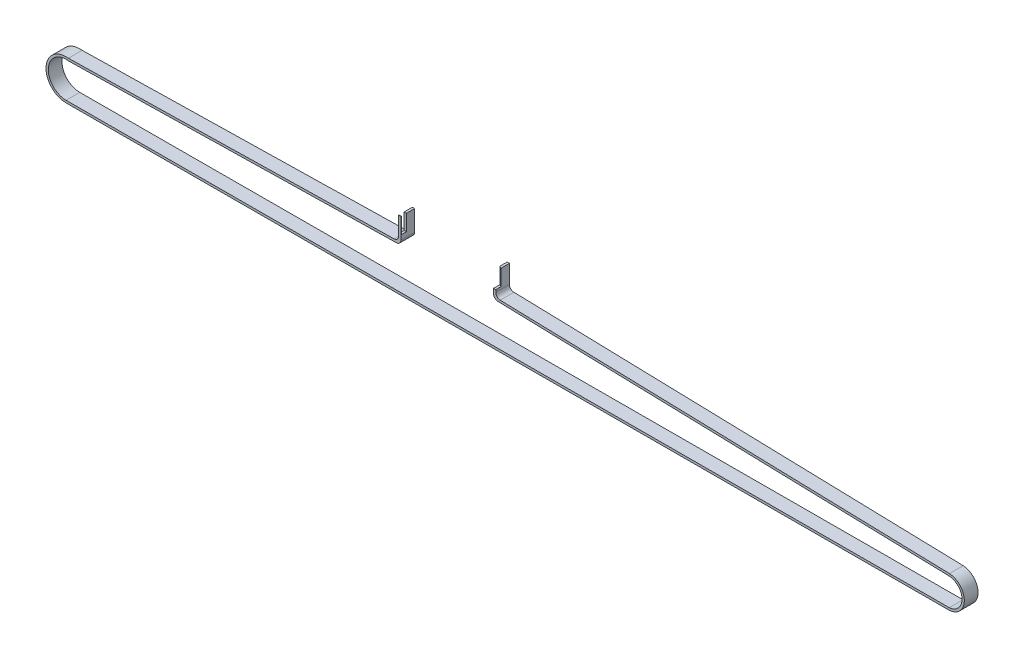
ISO-10303-21;
HEADER;
FILE_DESCRIPTION(('STEP AP214'),'2;1');
FILE_NAME('part.step','',(''),(''),'','','');
FILE_SCHEMA(('AUTOMOTIVE_DESIGN { 1 0 10303 214 1 1 1 1 }'));
ENDSEC;
DATA;
#1=APPLICATION_CONTEXT('core data for automotive mechanical design processes');
#2=APPLICATION_PROTOCOL_DEFINITION('international standard','automotive_design',2000,#1);
#3=PRODUCT_CONTEXT('',#1,'mechanical');
#4=PRODUCT('Part','Part','',(#3));
#5=PRODUCT_RELATED_PRODUCT_CATEGORY('part','',(#4));
#6=PRODUCT_DEFINITION_FORMATION('','',#4);
#7=PRODUCT_DEFINITION_CONTEXT('part definition',#1,'design');
#8=PRODUCT_DEFINITION('design','',#6,#7);
#9=PRODUCT_DEFINITION_SHAPE('','',#8);
#10=(LENGTH_UNIT() NAMED_UNIT(*) SI_UNIT(.MILLI.,.METRE.));
#11=(NAMED_UNIT(*) PLANE_ANGLE_UNIT() SI_UNIT($,.RADIAN.));
#12=(NAMED_UNIT(*) SI_UNIT($,.STERADIAN.) SOLID_ANGLE_UNIT());
#13=UNCERTAINTY_MEASURE_WITH_UNIT(LENGTH_MEASURE(1.E-05),#10,'distance_accuracy_value','');
#14=(GEOMETRIC_REPRESENTATION_CONTEXT(3) GLOBAL_UNCERTAINTY_ASSIGNED_CONTEXT((#13)) GLOBAL_UNIT_ASSIGNED_CONTEXT((#10,
#11,#12)) REPRESENTATION_CONTEXT('',''));
#15=CARTESIAN_POINT('',(0.,0.,0.));
#16=DIRECTION('',(0.,0.,1.));
#17=DIRECTION('',(1.,0.,0.));
#18=AXIS2_PLACEMENT_3D('',#15,#16,#17);
#19=CARTESIAN_POINT('',(-77.6123917073383,-109.1707684477,6.56356693467296));
#20=DIRECTION('',(0.,1.,0.));
#21=DIRECTION('',(0.,0.,1.));
#22=AXIS2_PLACEMENT_3D('',#19,#20,#21);
#23=PLANE('',#22);
#24=CARTESIAN_POINT('',(-76.3043909029961,-109.1707684477,2.20000000000011));
#25=DIRECTION('',(0.,1.,0.));
#26=DIRECTION('',(0.,0.,1.));
#27=AXIS2_PLACEMENT_3D('',#24,#25,#26);
#28=CIRCLE('',#27,2.);
#29=CARTESIAN_POINT('',(-76.6123917073383,-109.1707684477,4.17614156996025));
#30=VERTEX_POINT('',#29);
#31=CARTESIAN_POINT('',(-77.6123917073383,-109.1707684477,3.71298839910964));
#32=VERTEX_POINT('',#31);
#33=EDGE_CURVE('E20',#30,#32,#28,.F.);
#34=ORIENTED_EDGE('',*,*,#33,.F.);
#35=DIRECTION('',(0.,0.,-1.));
#36=VECTOR('',#35,1.);
#37=CARTESIAN_POINT('',(-76.6123917073383,-109.1707684477,6.56356693467296));
#38=LINE('',#37,#36);
#39=CARTESIAN_POINT('',(-76.6123917073383,-109.1707684477,0.563566934672959));
#40=VERTEX_POINT('',#39);
#41=EDGE_CURVE('E186',#40,#30,#38,.F.);
#42=ORIENTED_EDGE('',*,*,#41,.F.);
#43=DIRECTION('',(1.,0.,0.));
#44=VECTOR('',#43,1.);
#45=CARTESIAN_POINT('',(-77.6123917073383,-109.1707684477,0.563566934672959));
#46=LINE('',#45,#44);
#47=CARTESIAN_POINT('',(-77.4542112466602,-109.1707684477,0.563566934672959));
#48=VERTEX_POINT('',#47);
#49=EDGE_CURVE('E193',#40,#48,#46,.F.);
#50=ORIENTED_EDGE('',*,*,#49,.T.);
#51=CARTESIAN_POINT('',(-76.3043909029961,-109.1707684477,2.20000000000011));
#52=DIRECTION('',(0.,1.,0.));
#53=DIRECTION('',(0.,0.,1.));
#54=AXIS2_PLACEMENT_3D('',#51,#52,#53);
#55=CIRCLE('',#54,2.);
#56=CARTESIAN_POINT('',(-77.6123917073383,-109.1707684477,0.687011600890581));
#57=VERTEX_POINT('',#56);
#58=EDGE_CURVE('E207',#57,#48,#55,.F.);
#59=ORIENTED_EDGE('',*,*,#58,.F.);
#60=DIRECTION('',(0.,0.,-1.));
#61=VECTOR('',#60,1.);
#62=CARTESIAN_POINT('',(-77.6123917073383,-109.1707684477,6.56356693467296));
#63=LINE('',#62,#61);
#64=EDGE_CURVE('E189',#57,#32,#63,.F.);
#65=ORIENTED_EDGE('',*,*,#64,.T.);
#66=EDGE_LOOP('',(#34,#42,#50,#59,#65));
#67=FACE_BOUND('',#66,.T.);
#68=ADVANCED_FACE('F17',(#67),#23,.T.);
#69=CARTESIAN_POINT('',(-76.3043909029961,-116.170768447701,2.20000000000011));
#70=DIRECTION('',(0.,1.,0.));
#71=DIRECTION('',(0.,0.,1.));
#72=AXIS2_PLACEMENT_3D('',#69,#70,#71);
#73=CYLINDRICAL_SURFACE('',#72,2.);
#74=CARTESIAN_POINT('',(-76.3043909029961,-116.170768447701,2.20000000000011));
#75=DIRECTION('',(0.,1.,0.));
#76=DIRECTION('',(0.,0.,1.));
#77=AXIS2_PLACEMENT_3D('',#74,#75,#76);
#78=CIRCLE('',#77,2.);
#79=CARTESIAN_POINT('',(-76.6123917073383,-116.170768447701,4.17614156996025));
#80=VERTEX_POINT('',#79);
#81=CARTESIAN_POINT('',(-77.6123917073383,-116.170768447701,3.71298839910964));
#82=VERTEX_POINT('',#81);
#83=EDGE_CURVE('E192',#80,#82,#78,.F.);
#84=ORIENTED_EDGE('',*,*,#83,.F.);
#85=DIRECTION('',(0.,1.,0.));
#86=VECTOR('',#85,1.);
#87=CARTESIAN_POINT('',(-76.6123917073383,-120.096434525264,4.17614156996025));
#88=LINE('',#87,#86);
#89=EDGE_CURVE('E195',#30,#80,#88,.F.);
#90=ORIENTED_EDGE('',*,*,#89,.F.);
#91=ORIENTED_EDGE('',*,*,#33,.T.);
#92=DIRECTION('',(0.,1.,0.));
#93=VECTOR('',#92,1.);
#94=CARTESIAN_POINT('',(-77.6123917073383,-120.096434525264,3.71298839910964));
#95=LINE('',#94,#93);
#96=EDGE_CURVE('E268',#32,#82,#95,.F.);
#97=ORIENTED_EDGE('',*,*,#96,.T.);
#98=EDGE_LOOP('',(#84,#90,#91,#97));
#99=FACE_BOUND('',#98,.T.);
#100=ADVANCED_FACE('F196',(#99),#73,.T.);
#101=CARTESIAN_POINT('',(-76.3043909029961,-116.170768447701,2.20000000000011));
#102=DIRECTION('',(0.,1.,0.));
#103=DIRECTION('',(0.,0.,1.));
#104=AXIS2_PLACEMENT_3D('',#101,#102,#103);
#105=PLANE('',#104);
#106=DIRECTION('',(1.,0.,0.));
#107=VECTOR('',#106,1.);
#108=CARTESIAN_POINT('',(-76.3043909029961,-116.170768447701,6.56356693467296));
#109=LINE('',#108,#107);
#110=CARTESIAN_POINT('',(-77.6123917073383,-116.170768447701,6.56356693467296));
#111=VERTEX_POINT('',#110);
#112=CARTESIAN_POINT('',(-76.6123917073383,-116.170768447701,6.56356693467296));
#113=VERTEX_POINT('',#112);
#114=EDGE_CURVE('E270',#111,#113,#109,.T.);
#115=ORIENTED_EDGE('',*,*,#114,.T.);
#116=DIRECTION('',(0.,0.,-1.));
#117=VECTOR('',#116,1.);
#118=CARTESIAN_POINT('',(-76.6123917073383,-116.170768447701,6.56356693467296));
#119=LINE('',#118,#117);
#120=EDGE_CURVE('E201',#80,#113,#119,.F.);
#121=ORIENTED_EDGE('',*,*,#120,.F.);
#122=ORIENTED_EDGE('',*,*,#83,.T.);
#123=DIRECTION('',(0.,0.,-1.));
#124=VECTOR('',#123,1.);
#125=CARTESIAN_POINT('',(-77.6123917073383,-116.170768447701,6.56356693467296));
#126=LINE('',#125,#124);
#127=EDGE_CURVE('E238',#82,#111,#126,.F.);
#128=ORIENTED_EDGE('',*,*,#127,.T.);
#129=EDGE_LOOP('',(#115,#121,#122,#128));
#130=FACE_BOUND('',#129,.T.);
#131=ADVANCED_FACE('F355',(#130),#105,.T.);
#132=CARTESIAN_POINT('',(-118.921768143894,-116.170768447701,2.20000000000011));
#133=DIRECTION('',(0.,1.,0.));
#134=DIRECTION('',(0.,0.,1.));
#135=AXIS2_PLACEMENT_3D('',#132,#133,#134);
#136=CYLINDRICAL_SURFACE('',#135,4.17693228606131);
#137=CARTESIAN_POINT('',(-118.921768143894,-116.170768447701,2.20000000000011));
#138=DIRECTION('',(0.,1.,0.));
#139=DIRECTION('',(0.,0.,1.));
#140=AXIS2_PLACEMENT_3D('',#137,#138,#139);
#141=CIRCLE('',#140,4.17693228606131);
#142=CARTESIAN_POINT('',(-119.111696821927,-116.170768447701,6.37261194212965));
#143=VERTEX_POINT('',#142);
#144=CARTESIAN_POINT('',(-118.111696821927,-116.170768447701,6.2976270908501));
#145=VERTEX_POINT('',#144);
#146=EDGE_CURVE('E273',#143,#145,#141,.T.);
#147=ORIENTED_EDGE('',*,*,#146,.F.);
#148=DIRECTION('',(0.,1.,0.));
#149=VECTOR('',#148,1.);
#150=CARTESIAN_POINT('',(-119.111696821927,-120.096434525272,6.37261194212965));
#151=LINE('',#150,#149);
#152=CARTESIAN_POINT('',(-119.111696821927,-109.1707684477,6.37261194212965));
#153=VERTEX_POINT('',#152);
#154=EDGE_CURVE('E243',#153,#143,#151,.F.);
#155=ORIENTED_EDGE('',*,*,#154,.F.);
#156=CARTESIAN_POINT('',(-118.921768143894,-109.1707684477,2.20000000000011));
#157=DIRECTION('',(0.,1.,0.));
#158=DIRECTION('',(0.,0.,1.));
#159=AXIS2_PLACEMENT_3D('',#156,#157,#158);
#160=CIRCLE('',#159,4.17693228606131);
#161=CARTESIAN_POINT('',(-118.111696821927,-109.1707684477,6.2976270908501));
#162=VERTEX_POINT('',#161);
#163=EDGE_CURVE('E262',#162,#153,#160,.F.);
#164=ORIENTED_EDGE('',*,*,#163,.F.);
#165=DIRECTION('',(0.,1.,0.));
#166=VECTOR('',#165,1.);
#167=CARTESIAN_POINT('',(-118.111696821927,-120.096434525272,6.2976270908501));
#168=LINE('',#167,#166);
#169=EDGE_CURVE('E257',#162,#145,#168,.F.);
#170=ORIENTED_EDGE('',*,*,#169,.T.);
#171=EDGE_LOOP('',(#147,#155,#164,#170));
#172=FACE_BOUND('',#171,.T.);
#173=ADVANCED_FACE('F792',(#172),#136,.F.);
#174=CARTESIAN_POINT('',(-118.921768143894,-116.170768447701,2.20000000000011));
#175=DIRECTION('',(0.,1.,0.));
#176=DIRECTION('',(0.,0.,1.));
#177=AXIS2_PLACEMENT_3D('',#174,#175,#176);
#178=PLANE('',#177);
#179=DIRECTION('',(0.,0.,1.));
#180=VECTOR('',#179,1.);
#181=CARTESIAN_POINT('',(-119.111696821927,-116.170768447701,6.56356693467296));
#182=LINE('',#181,#180);
#183=CARTESIAN_POINT('',(-119.111696821927,-116.170768447701,4.1909613500169));
#184=VERTEX_POINT('',#183);
#185=EDGE_CURVE('E246',#143,#184,#182,.F.);
#186=ORIENTED_EDGE('',*,*,#185,.F.);
#187=ORIENTED_EDGE('',*,*,#146,.T.);
#188=DIRECTION('',(0.,0.,1.));
#189=VECTOR('',#188,1.);
#190=CARTESIAN_POINT('',(-118.111696821927,-116.170768447701,6.56356693467296));
#191=LINE('',#190,#189);
#192=CARTESIAN_POINT('',(-118.111696821927,-116.170768447701,4.02860177549044));
#193=VERTEX_POINT('',#192);
#194=EDGE_CURVE('E259',#145,#193,#191,.F.);
#195=ORIENTED_EDGE('',*,*,#194,.T.);
#196=CARTESIAN_POINT('',(-118.921768143894,-116.170768447701,2.20000000000011));
#197=DIRECTION('',(0.,1.,0.));
#198=DIRECTION('',(0.,0.,1.));
#199=AXIS2_PLACEMENT_3D('',#196,#197,#198);
#200=CIRCLE('',#199,2.);
#201=EDGE_CURVE('E349',#184,#193,#200,.T.);
#202=ORIENTED_EDGE('',*,*,#201,.F.);
#203=EDGE_LOOP('',(#186,#187,#195,#202));
#204=FACE_BOUND('',#203,.T.);
#205=ADVANCED_FACE('F782',(#204),#178,.T.);
#206=CARTESIAN_POINT('',(-118.921768143894,-116.170768447701,2.20000000000011));
#207=DIRECTION('',(0.,1.,0.));
#208=DIRECTION('',(0.,0.,1.));
#209=AXIS2_PLACEMENT_3D('',#206,#207,#208);
#210=CYLINDRICAL_SURFACE('',#209,2.);
#211=CARTESIAN_POINT('',(-118.921768143894,-109.1707684477,2.20000000000011));
#212=DIRECTION('',(0.,1.,0.));
#213=DIRECTION('',(0.,0.,1.));
#214=AXIS2_PLACEMENT_3D('',#211,#212,#213);
#215=CIRCLE('',#214,2.);
#216=CARTESIAN_POINT('',(-119.111696821927,-109.1707684477,4.1909613500169));
#217=VERTEX_POINT('',#216);
#218=CARTESIAN_POINT('',(-118.111696821927,-109.1707684477,4.02860177549044));
#219=VERTEX_POINT('',#218);
#220=EDGE_CURVE('E252',#217,#219,#215,.T.);
#221=ORIENTED_EDGE('',*,*,#220,.F.);
#222=DIRECTION('',(0.,1.,0.));
#223=VECTOR('',#222,1.);
#224=CARTESIAN_POINT('',(-119.111696821927,-120.096434525272,4.1909613500169));
#225=LINE('',#224,#223);
#226=EDGE_CURVE('E224',#184,#217,#225,.T.);
#227=ORIENTED_EDGE('',*,*,#226,.F.);
#228=ORIENTED_EDGE('',*,*,#201,.T.);
#229=DIRECTION('',(0.,1.,0.));
#230=VECTOR('',#229,1.);
#231=CARTESIAN_POINT('',(-118.111696821927,-120.096434525272,4.02860177549044));
#232=LINE('',#231,#230);
#233=EDGE_CURVE('E231',#193,#219,#232,.T.);
#234=ORIENTED_EDGE('',*,*,#233,.T.);
#235=EDGE_LOOP('',(#221,#227,#228,#234));
#236=FACE_BOUND('',#235,.T.);
#237=ADVANCED_FACE('F772',(#236),#210,.T.);
#238=CARTESIAN_POINT('',(-119.111696821927,-109.1707684477,6.56356693467296));
#239=DIRECTION('',(0.,1.,0.));
#240=DIRECTION('',(0.,0.,1.));
#241=AXIS2_PLACEMENT_3D('',#238,#239,#240);
#242=PLANE('',#241);
#243=DIRECTION('',(0.,0.,1.));
#244=VECTOR('',#243,1.);
#245=CARTESIAN_POINT('',(-118.111696821927,-109.1707684477,6.56356693467296));
#246=LINE('',#245,#244);
#247=CARTESIAN_POINT('',(-118.111696821927,-109.1707684477,0.563566934672959));
#248=VERTEX_POINT('',#247);
#249=EDGE_CURVE('E227',#219,#248,#246,.F.);
#250=ORIENTED_EDGE('',*,*,#249,.T.);
#251=DIRECTION('',(1.,0.,0.));
#252=VECTOR('',#251,1.);
#253=CARTESIAN_POINT('',(-119.111696821927,-109.1707684477,0.563566934672959));
#254=LINE('',#253,#252);
#255=CARTESIAN_POINT('',(-119.111696821927,-109.1707684477,0.563566934672959));
#256=VERTEX_POINT('',#255);
#257=EDGE_CURVE('E202',#248,#256,#254,.F.);
#258=ORIENTED_EDGE('',*,*,#257,.T.);
#259=DIRECTION('',(0.,0.,1.));
#260=VECTOR('',#259,1.);
#261=CARTESIAN_POINT('',(-119.111696821927,-109.1707684477,6.56356693467296));
#262=LINE('',#261,#260);
#263=EDGE_CURVE('E220',#217,#256,#262,.F.);
#264=ORIENTED_EDGE('',*,*,#263,.F.);
#265=ORIENTED_EDGE('',*,*,#220,.T.);
#266=EDGE_LOOP('',(#250,#258,#264,#265));
#267=FACE_BOUND('',#266,.T.);
#268=ADVANCED_FACE('F512',(#267),#242,.T.);
#269=CARTESIAN_POINT('',(-76.6123917073383,-120.096434525264,6.56356693467296));
#270=DIRECTION('',(1.,0.,0.));
#271=DIRECTION('',(0.,0.,-1.));
#272=AXIS2_PLACEMENT_3D('',#269,#270,#271);
#273=PLANE('',#272);
#274=DIRECTION('',(0.,1.,0.));
#275=VECTOR('',#274,1.);
#276=CARTESIAN_POINT('',(-76.6123917073383,-130.657156953866,0.563566934672959));
#277=LINE('',#276,#275);
#278=CARTESIAN_POINT('',(-76.6123917073383,-117.176487603258,0.563566934672959));
#279=VERTEX_POINT('',#278);
#280=EDGE_CURVE('E206',#279,#40,#277,.T.);
#281=ORIENTED_EDGE('',*,*,#280,.T.);
#282=ORIENTED_EDGE('',*,*,#41,.T.);
#283=ORIENTED_EDGE('',*,*,#89,.T.);
#284=ORIENTED_EDGE('',*,*,#120,.T.);
#285=DIRECTION('',(0.,1.,0.));
#286=VECTOR('',#285,1.);
#287=CARTESIAN_POINT('',(-76.6123917073383,-120.096434525264,6.56356693467296));
#288=LINE('',#287,#286);
#289=CARTESIAN_POINT('',(-76.6123917073383,-117.176487603258,6.56356693467296));
#290=VERTEX_POINT('',#289);
#291=EDGE_CURVE('E208',#113,#290,#288,.F.);
#292=ORIENTED_EDGE('',*,*,#291,.T.);
#293=DIRECTION('',(0.,0.,1.));
#294=VECTOR('',#293,1.);
#295=CARTESIAN_POINT('',(-76.6123917073383,-117.176487603258,6.56356693467296));
#296=LINE('',#295,#294);
#297=EDGE_CURVE('E392',#290,#279,#296,.F.);
#298=ORIENTED_EDGE('',*,*,#297,.T.);
#299=EDGE_LOOP('',(#281,#282,#283,#284,#292,#298));
#300=FACE_BOUND('',#299,.T.);
#301=ADVANCED_FACE('F204',(#300),#273,.T.);
#302=CARTESIAN_POINT('',(-76.3043909029961,-116.170768447701,2.20000000000011));
#303=DIRECTION('',(0.,1.,0.));
#304=DIRECTION('',(0.,0.,1.));
#305=AXIS2_PLACEMENT_3D('',#302,#303,#304);
#306=CYLINDRICAL_SURFACE('',#305,2.);
#307=DIRECTION('',(0.,1.,0.));
#308=VECTOR('',#307,1.);
#309=CARTESIAN_POINT('',(-77.4542112466602,-130.657156953866,0.563566934672959));
#310=LINE('',#309,#308);
#311=CARTESIAN_POINT('',(-77.4542112466602,-116.170768447701,0.563566934672959));
#312=VERTEX_POINT('',#311);
#313=EDGE_CURVE('E366',#48,#312,#310,.F.);
#314=ORIENTED_EDGE('',*,*,#313,.T.);
#315=CARTESIAN_POINT('',(-76.3043909029961,-116.170768447701,2.20000000000011));
#316=DIRECTION('',(0.,1.,0.));
#317=DIRECTION('',(0.,0.,1.));
#318=AXIS2_PLACEMENT_3D('',#315,#316,#317);
#319=CIRCLE('',#318,2.);
#320=CARTESIAN_POINT('',(-77.6123917073383,-116.170768447701,0.687011600890581));
#321=VERTEX_POINT('',#320);
#322=EDGE_CURVE('E211',#321,#312,#319,.F.);
#323=ORIENTED_EDGE('',*,*,#322,.F.);
#324=DIRECTION('',(0.,1.,0.));
#325=VECTOR('',#324,1.);
#326=CARTESIAN_POINT('',(-77.6123917073383,-120.096434525264,0.687011600890582));
#327=LINE('',#326,#325);
#328=EDGE_CURVE('E265',#321,#57,#327,.T.);
#329=ORIENTED_EDGE('',*,*,#328,.T.);
#330=ORIENTED_EDGE('',*,*,#58,.T.);
#331=EDGE_LOOP('',(#314,#323,#329,#330));
#332=FACE_BOUND('',#331,.T.);
#333=ADVANCED_FACE('F503',(#332),#306,.T.);
#334=CARTESIAN_POINT('',(-76.3043909029961,-116.170768447701,2.20000000000011));
#335=DIRECTION('',(0.,1.,0.));
#336=DIRECTION('',(0.,0.,1.));
#337=AXIS2_PLACEMENT_3D('',#334,#335,#336);
#338=PLANE('',#337);
#339=ORIENTED_EDGE('',*,*,#322,.T.);
#340=DIRECTION('',(1.,0.,0.));
#341=VECTOR('',#340,1.);
#342=CARTESIAN_POINT('',(-264.648815476265,-116.170768447701,0.563566934672959));
#343=LINE('',#342,#341);
#344=CARTESIAN_POINT('',(-77.6123917073383,-116.170768447701,0.563566934672959));
#345=VERTEX_POINT('',#344);
#346=EDGE_CURVE('E321',#312,#345,#343,.F.);
#347=ORIENTED_EDGE('',*,*,#346,.T.);
#348=DIRECTION('',(0.,0.,-1.));
#349=VECTOR('',#348,1.);
#350=CARTESIAN_POINT('',(-77.6123917073383,-116.170768447701,6.56356693467296));
#351=LINE('',#350,#349);
#352=EDGE_CURVE('E234',#345,#321,#351,.F.);
#353=ORIENTED_EDGE('',*,*,#352,.T.);
#354=EDGE_LOOP('',(#339,#347,#353));
#355=FACE_BOUND('',#354,.T.);
#356=ADVANCED_FACE('F371',(#355),#338,.T.);
#357=CARTESIAN_POINT('',(-77.6123917073383,-120.096434525264,6.56356693467296));
#358=DIRECTION('',(1.,0.,0.));
#359=DIRECTION('',(0.,0.,-1.));
#360=AXIS2_PLACEMENT_3D('',#357,#358,#359);
#361=PLANE('',#360);
#362=DIRECTION('',(0.,1.,0.));
#363=VECTOR('',#362,1.);
#364=CARTESIAN_POINT('',(-77.6123917073383,-130.657156953866,0.563566934672959));
#365=LINE('',#364,#363);
#366=CARTESIAN_POINT('',(-77.6123917073383,-118.149803243927,0.563566934672959));
#367=VERTEX_POINT('',#366);
#368=EDGE_CURVE('E342',#345,#367,#365,.F.);
#369=ORIENTED_EDGE('',*,*,#368,.T.);
#370=DIRECTION('',(0.,0.,-1.));
#371=VECTOR('',#370,1.);
#372=CARTESIAN_POINT('',(-77.6123917073383,-118.149803243927,6.56356693467296));
#373=LINE('',#372,#371);
#374=CARTESIAN_POINT('',(-77.6123917073383,-118.149803243927,6.56356693467296));
#375=VERTEX_POINT('',#374);
#376=EDGE_CURVE('E237',#375,#367,#373,.T.);
#377=ORIENTED_EDGE('',*,*,#376,.F.);
#378=DIRECTION('',(0.,1.,0.));
#379=VECTOR('',#378,1.);
#380=CARTESIAN_POINT('',(-77.6123917073383,-130.657156953866,6.56356693467296));
#381=LINE('',#380,#379);
#382=EDGE_CURVE('E316',#111,#375,#381,.F.);
#383=ORIENTED_EDGE('',*,*,#382,.F.);
#384=ORIENTED_EDGE('',*,*,#127,.F.);
#385=ORIENTED_EDGE('',*,*,#96,.F.);
#386=ORIENTED_EDGE('',*,*,#64,.F.);
#387=ORIENTED_EDGE('',*,*,#328,.F.);
#388=ORIENTED_EDGE('',*,*,#352,.F.);
#389=EDGE_LOOP('',(#369,#377,#383,#384,#385,#386,#387,#388));
#390=FACE_BOUND('',#389,.T.);
#391=ADVANCED_FACE('F358',(#390),#361,.F.);
#392=CARTESIAN_POINT('',(-75.6123917073383,-118.149803243927,6.56356693467296));
#393=DIRECTION('',(0.,0.,-1.));
#394=DIRECTION('',(-1.,0.,0.));
#395=AXIS2_PLACEMENT_3D('',#392,#393,#394);
#396=CYLINDRICAL_SURFACE('',#395,2.);
#397=CARTESIAN_POINT('',(-75.6123917073383,-118.149803243927,0.563566934672959));
#398=DIRECTION('',(0.,0.,-1.));
#399=DIRECTION('',(-1.,0.,0.));
#400=AXIS2_PLACEMENT_3D('',#397,#398,#399);
#401=CIRCLE('',#400,2.);
#402=CARTESIAN_POINT('',(-75.666472220668,-120.149071934743,0.563566934672958));
#403=VERTEX_POINT('',#402);
#404=EDGE_CURVE('E340',#367,#403,#401,.F.);
#405=ORIENTED_EDGE('',*,*,#404,.T.);
#406=DIRECTION('',(0.,0.,1.));
#407=VECTOR('',#406,1.);
#408=CARTESIAN_POINT('',(-75.666472220668,-120.149071934743,6.56356693467296));
#409=LINE('',#408,#407);
#410=CARTESIAN_POINT('',(-75.666472220668,-120.149071934743,6.56356693467296));
#411=VERTEX_POINT('',#410);
#412=EDGE_CURVE('E424',#403,#411,#409,.T.);
#413=ORIENTED_EDGE('',*,*,#412,.T.);
#414=CARTESIAN_POINT('',(-75.6123917073383,-118.149803243927,6.56356693467296));
#415=DIRECTION('',(0.,0.,-1.));
#416=DIRECTION('',(-1.,0.,0.));
#417=AXIS2_PLACEMENT_3D('',#414,#415,#416);
#418=CIRCLE('',#417,2.);
#419=EDGE_CURVE('E313',#375,#411,#418,.F.);
#420=ORIENTED_EDGE('',*,*,#419,.F.);
#421=ORIENTED_EDGE('',*,*,#376,.T.);
#422=EDGE_LOOP('',(#405,#413,#420,#421));
#423=FACE_BOUND('',#422,.T.);
#424=ADVANCED_FACE('F429',(#423),#396,.T.);
#425=CARTESIAN_POINT('',(121.836852943332,-125.491566046838,6.56356693467296));
#426=DIRECTION('',(0.0270402566648223,0.99963434540811,0.));
#427=DIRECTION('',(-0.99963434540811,0.0270402566648223,0.));
#428=AXIS2_PLACEMENT_3D('',#425,#426,#427);
#429=PLANE('',#428);
#430=ORIENTED_EDGE('',*,*,#412,.F.);
#431=DIRECTION('',(0.99963434540811,-0.0270402566648222,0.));
#432=VECTOR('',#431,1.);
#433=CARTESIAN_POINT('',(-75.666472220668,-120.149071934743,0.563566934672959));
#434=LINE('',#433,#432);
#435=CARTESIAN_POINT('',(121.836852943332,-125.491566046838,0.563566934672959));
#436=VERTEX_POINT('',#435);
#437=EDGE_CURVE('E339',#403,#436,#434,.T.);
#438=ORIENTED_EDGE('',*,*,#437,.T.);
#439=DIRECTION('',(0.,0.,-1.));
#440=VECTOR('',#439,1.);
#441=CARTESIAN_POINT('',(121.836852943332,-125.491566046838,6.56356693467296));
#442=LINE('',#441,#440);
#443=CARTESIAN_POINT('',(121.836852943332,-125.491566046838,6.56356693467296));
#444=VERTEX_POINT('',#443);
#445=EDGE_CURVE('E423',#436,#444,#442,.F.);
#446=ORIENTED_EDGE('',*,*,#445,.T.);
#447=DIRECTION('',(0.99963434540811,-0.0270402566648222,0.));
#448=VECTOR('',#447,1.);
#449=CARTESIAN_POINT('',(-75.666472220668,-120.149071934743,6.56356693467296));
#450=LINE('',#449,#448);
#451=EDGE_CURVE('E312',#411,#444,#450,.T.);
#452=ORIENTED_EDGE('',*,*,#451,.F.);
#453=EDGE_LOOP('',(#430,#438,#446,#452));
#454=FACE_BOUND('',#453,.T.);
#455=ADVANCED_FACE('F572',(#454),#429,.F.);
#456=CARTESIAN_POINT('',(121.394517857936,-131.470824001945,6.56356693467296));
#457=DIRECTION('',(0.,0.,-1.));
#458=DIRECTION('',(-1.,0.,0.));
#459=AXIS2_PLACEMENT_3D('',#456,#457,#458);
#460=CYLINDRICAL_SURFACE('',#459,5.99559721975081);
#461=DIRECTION('',(0.,0.,1.));
#462=VECTOR('',#461,1.);
#463=CARTESIAN_POINT('',(121.825156451343,-137.450935741984,6.56356693467296));
#464=LINE('',#463,#462);
#465=CARTESIAN_POINT('',(121.825156451343,-137.450935741984,0.563566934672958));
#466=VERTEX_POINT('',#465);
#467=CARTESIAN_POINT('',(121.825156451343,-137.450935741984,6.56356693467296));
#468=VERTEX_POINT('',#467);
#469=EDGE_CURVE('E421',#466,#468,#464,.T.);
#470=ORIENTED_EDGE('',*,*,#469,.T.);
#471=CARTESIAN_POINT('',(121.394517857936,-131.470824001945,6.56356693467296));
#472=DIRECTION('',(0.,0.,-1.));
#473=DIRECTION('',(-1.,0.,0.));
#474=AXIS2_PLACEMENT_3D('',#471,#472,#473);
#475=CIRCLE('',#474,5.99559721975081);
#476=EDGE_CURVE('E309',#444,#468,#475,.T.);
#477=ORIENTED_EDGE('',*,*,#476,.F.);
#478=ORIENTED_EDGE('',*,*,#445,.F.);
#479=CARTESIAN_POINT('',(121.394517857936,-131.470824001945,0.563566934672959));
#480=DIRECTION('',(0.,0.,-1.));
#481=DIRECTION('',(-1.,0.,0.));
#482=AXIS2_PLACEMENT_3D('',#479,#480,#481);
#483=CIRCLE('',#482,5.99559721975081);
#484=EDGE_CURVE('E337',#436,#466,#483,.T.);
#485=ORIENTED_EDGE('',*,*,#484,.T.);
#486=EDGE_LOOP('',(#470,#477,#478,#485));
#487=FACE_BOUND('',#486,.T.);
#488=ADVANCED_FACE('F569',(#487),#460,.F.);
#489=CARTESIAN_POINT('',(-264.629528335664,-138.412080698056,6.56356693467296));
#490=DIRECTION('',(0.00248707551312212,-0.999996907222913,0.));
#491=DIRECTION('',(0.999996907222913,0.00248707551312212,0.));
#492=AXIS2_PLACEMENT_3D('',#489,#490,#491);
#493=PLANE('',#492);
#494=DIRECTION('',(0.,0.,-1.));
#495=VECTOR('',#494,1.);
#496=CARTESIAN_POINT('',(-264.629528335664,-138.412080698056,6.56356693467296));
#497=LINE('',#496,#495);
#498=CARTESIAN_POINT('',(-264.629528335664,-138.412080698056,0.563566934672959));
#499=VERTEX_POINT('',#498);
#500=CARTESIAN_POINT('',(-264.629528335664,-138.412080698056,6.56356693467296));
#501=VERTEX_POINT('',#500);
#502=EDGE_CURVE('E418',#499,#501,#497,.F.);
#503=ORIENTED_EDGE('',*,*,#502,.T.);
#504=DIRECTION('',(-0.999996907222913,-0.00248707551312205,0.));
#505=VECTOR('',#504,1.);
#506=CARTESIAN_POINT('',(121.825156451343,-137.450935741984,6.56356693467296));
#507=LINE('',#506,#505);
#508=EDGE_CURVE('E308',#468,#501,#507,.T.);
#509=ORIENTED_EDGE('',*,*,#508,.F.);
#510=ORIENTED_EDGE('',*,*,#469,.F.);
#511=DIRECTION('',(-0.999996907222913,-0.00248707551312205,0.));
#512=VECTOR('',#511,1.);
#513=CARTESIAN_POINT('',(121.825156451343,-137.450935741984,0.563566934672959));
#514=LINE('',#513,#512);
#515=EDGE_CURVE('E336',#466,#499,#514,.T.);
#516=ORIENTED_EDGE('',*,*,#515,.T.);
#517=EDGE_LOOP('',(#503,#509,#510,#516));
#518=FACE_BOUND('',#517,.T.);
#519=ADVANCED_FACE('F466',(#518),#493,.F.);
#520=CARTESIAN_POINT('',(-264.648815476265,-130.657156953866,6.56356693467296));
#521=DIRECTION('',(0.,0.,-1.));
#522=DIRECTION('',(-1.,0.,0.));
#523=AXIS2_PLACEMENT_3D('',#520,#521,#522);
#524=CYLINDRICAL_SURFACE('',#523,7.75494772851443);
#525=CARTESIAN_POINT('',(-264.648815476265,-130.657156953866,6.56356693467296));
#526=DIRECTION('',(0.,0.,-1.));
#527=DIRECTION('',(-1.,0.,0.));
#528=AXIS2_PLACEMENT_3D('',#525,#526,#527);
#529=CIRCLE('',#528,7.75494772851443);
#530=CARTESIAN_POINT('',(-263.662284962799,-122.965214948235,6.56356693467296));
#531=VERTEX_POINT('',#530);
#532=EDGE_CURVE('E305',#501,#531,#529,.T.);
#533=ORIENTED_EDGE('',*,*,#532,.F.);
#534=ORIENTED_EDGE('',*,*,#502,.F.);
#535=CARTESIAN_POINT('',(-264.648815476265,-130.657156953866,0.563566934672959));
#536=DIRECTION('',(0.,0.,-1.));
#537=DIRECTION('',(-1.,0.,0.));
#538=AXIS2_PLACEMENT_3D('',#535,#536,#537);
#539=CIRCLE('',#538,7.75494772851443);
#540=CARTESIAN_POINT('',(-263.662284962799,-122.965214948235,0.563566934672958));
#541=VERTEX_POINT('',#540);
#542=EDGE_CURVE('E334',#499,#541,#539,.T.);
#543=ORIENTED_EDGE('',*,*,#542,.T.);
#544=DIRECTION('',(0.,0.,1.));
#545=VECTOR('',#544,1.);
#546=CARTESIAN_POINT('',(-263.662284962799,-122.965214948235,6.56356693467296));
#547=LINE('',#546,#545);
#548=EDGE_CURVE('E416',#541,#531,#547,.T.);
#549=ORIENTED_EDGE('',*,*,#548,.T.);
#550=EDGE_LOOP('',(#533,#534,#543,#549));
#551=FACE_BOUND('',#550,.T.);
#552=ADVANCED_FACE('F471',(#551),#524,.F.);
#553=CARTESIAN_POINT('',(-263.662284962799,-122.965214948235,6.56356693467296));
#554=DIRECTION('',(-0.0197060238129421,0.999805817459312,0.));
#555=DIRECTION('',(-0.999805817459312,-0.0197060238129421,0.));
#556=AXIS2_PLACEMENT_3D('',#553,#554,#555);
#557=PLANE('',#556);
#558=DIRECTION('',(0.,0.,-1.));
#559=VECTOR('',#558,1.);
#560=CARTESIAN_POINT('',(-120.072284774301,-120.135077421925,6.56356693467296));
#561=LINE('',#560,#559);
#562=CARTESIAN_POINT('',(-120.072284774301,-120.135077421925,6.56356693467296));
#563=VERTEX_POINT('',#562);
#564=CARTESIAN_POINT('',(-120.072284774301,-120.135077421925,0.563566934672959));
#565=VERTEX_POINT('',#564);
#566=EDGE_CURVE('E264',#563,#565,#561,.T.);
#567=ORIENTED_EDGE('',*,*,#566,.F.);
#568=DIRECTION('',(0.999805817459312,0.0197060238129421,0.));
#569=VECTOR('',#568,1.);
#570=CARTESIAN_POINT('',(-263.662284962799,-122.965214948235,6.56356693467296));
#571=LINE('',#570,#569);
#572=EDGE_CURVE('E304',#531,#563,#571,.T.);
#573=ORIENTED_EDGE('',*,*,#572,.F.);
#574=ORIENTED_EDGE('',*,*,#548,.F.);
#575=DIRECTION('',(0.999805817459312,0.0197060238129421,0.));
#576=VECTOR('',#575,1.);
#577=CARTESIAN_POINT('',(-263.662284962799,-122.965214948235,0.563566934672959));
#578=LINE('',#577,#576);
#579=EDGE_CURVE('E333',#541,#565,#578,.T.);
#580=ORIENTED_EDGE('',*,*,#579,.T.);
#581=EDGE_LOOP('',(#567,#573,#574,#580));
#582=FACE_BOUND('',#581,.T.);
#583=ADVANCED_FACE('F560',(#582),#557,.F.);
#584=CARTESIAN_POINT('',(-120.111696821927,-118.135465787006,6.56356693467296));
#585=DIRECTION('',(0.,0.,-1.));
#586=DIRECTION('',(-1.,0.,0.));
#587=AXIS2_PLACEMENT_3D('',#584,#585,#586);
#588=CYLINDRICAL_SURFACE('',#587,2.);
#589=CARTESIAN_POINT('',(-120.111696821927,-118.135465787006,0.563566934672959));
#590=DIRECTION('',(0.,0.,-1.));
#591=DIRECTION('',(-1.,0.,0.));
#592=AXIS2_PLACEMENT_3D('',#589,#590,#591);
#593=CIRCLE('',#592,2.);
#594=CARTESIAN_POINT('',(-118.111696821927,-118.135465787006,0.563566934672959));
#595=VERTEX_POINT('',#594);
#596=EDGE_CURVE('E330',#565,#595,#593,.F.);
#597=ORIENTED_EDGE('',*,*,#596,.T.);
#598=DIRECTION('',(0.,0.,1.));
#599=VECTOR('',#598,1.);
#600=CARTESIAN_POINT('',(-118.111696821927,-118.135465787006,6.56356693467296));
#601=LINE('',#600,#599);
#602=CARTESIAN_POINT('',(-118.111696821927,-118.135465787006,6.56356693467296));
#603=VERTEX_POINT('',#602);
#604=EDGE_CURVE('E230',#595,#603,#601,.T.);
#605=ORIENTED_EDGE('',*,*,#604,.T.);
#606=CARTESIAN_POINT('',(-120.111696821927,-118.135465787006,6.56356693467296));
#607=DIRECTION('',(0.,0.,-1.));
#608=DIRECTION('',(-1.,0.,0.));
#609=AXIS2_PLACEMENT_3D('',#606,#607,#608);
#610=CIRCLE('',#609,2.);
#611=EDGE_CURVE('E300',#563,#603,#610,.F.);
#612=ORIENTED_EDGE('',*,*,#611,.F.);
#613=ORIENTED_EDGE('',*,*,#566,.T.);
#614=EDGE_LOOP('',(#597,#605,#612,#613));
#615=FACE_BOUND('',#614,.T.);
#616=ADVANCED_FACE('F556',(#615),#588,.T.);
#617=CARTESIAN_POINT('',(-118.111696821927,-120.096434525272,6.56356693467296));
#618=DIRECTION('',(-1.,0.,0.));
#619=DIRECTION('',(0.,0.,1.));
#620=AXIS2_PLACEMENT_3D('',#617,#618,#619);
#621=PLANE('',#620);
#622=ORIENTED_EDGE('',*,*,#169,.F.);
#623=DIRECTION('',(0.,0.,1.));
#624=VECTOR('',#623,1.);
#625=CARTESIAN_POINT('',(-118.111696821927,-109.1707684477,6.56356693467296));
#626=LINE('',#625,#624);
#627=CARTESIAN_POINT('',(-118.111696821927,-109.1707684477,6.56356693467296));
#628=VERTEX_POINT('',#627);
#629=EDGE_CURVE('E247',#628,#162,#626,.F.);
#630=ORIENTED_EDGE('',*,*,#629,.F.);
#631=DIRECTION('',(0.,1.,0.));
#632=VECTOR('',#631,1.);
#633=CARTESIAN_POINT('',(-118.111696821927,-130.657156953866,6.56356693467296));
#634=LINE('',#633,#632);
#635=EDGE_CURVE('E303',#603,#628,#634,.T.);
#636=ORIENTED_EDGE('',*,*,#635,.F.);
#637=ORIENTED_EDGE('',*,*,#604,.F.);
#638=DIRECTION('',(0.,1.,0.));
#639=VECTOR('',#638,1.);
#640=CARTESIAN_POINT('',(-118.111696821927,-130.657156953866,0.563566934672959));
#641=LINE('',#640,#639);
#642=EDGE_CURVE('E332',#595,#248,#641,.T.);
#643=ORIENTED_EDGE('',*,*,#642,.T.);
#644=ORIENTED_EDGE('',*,*,#249,.F.);
#645=ORIENTED_EDGE('',*,*,#233,.F.);
#646=ORIENTED_EDGE('',*,*,#194,.F.);
#647=EDGE_LOOP('',(#622,#630,#636,#637,#643,#644,#645,#646));
#648=FACE_BOUND('',#647,.T.);
#649=ADVANCED_FACE('F552',(#648),#621,.F.);
#650=CARTESIAN_POINT('',(-119.111696821927,-109.1707684477,6.56356693467296));
#651=DIRECTION('',(0.,1.,0.));
#652=DIRECTION('',(0.,0.,1.));
#653=AXIS2_PLACEMENT_3D('',#650,#651,#652);
#654=PLANE('',#653);
#655=ORIENTED_EDGE('',*,*,#629,.T.);
#656=ORIENTED_EDGE('',*,*,#163,.T.);
#657=DIRECTION('',(0.,0.,1.));
#658=VECTOR('',#657,1.);
#659=CARTESIAN_POINT('',(-119.111696821927,-109.1707684477,6.56356693467296));
#660=LINE('',#659,#658);
#661=CARTESIAN_POINT('',(-119.111696821927,-109.1707684477,6.56356693467296));
#662=VERTEX_POINT('',#661);
#663=EDGE_CURVE('E223',#662,#153,#660,.F.);
#664=ORIENTED_EDGE('',*,*,#663,.F.);
#665=DIRECTION('',(1.,0.,0.));
#666=VECTOR('',#665,1.);
#667=CARTESIAN_POINT('',(-264.648815476265,-109.1707684477,6.56356693467296));
#668=LINE('',#667,#666);
#669=EDGE_CURVE('E404',#628,#662,#668,.F.);
#670=ORIENTED_EDGE('',*,*,#669,.F.);
#671=EDGE_LOOP('',(#655,#656,#664,#670));
#672=FACE_BOUND('',#671,.T.);
#673=ADVANCED_FACE('F548',(#672),#654,.T.);
#674=CARTESIAN_POINT('',(-119.111696821927,-120.096434525272,6.56356693467296));
#675=DIRECTION('',(-1.,0.,0.));
#676=DIRECTION('',(0.,0.,1.));
#677=AXIS2_PLACEMENT_3D('',#674,#675,#676);
#678=PLANE('',#677);
#679=DIRECTION('',(0.,1.,0.));
#680=VECTOR('',#679,1.);
#681=CARTESIAN_POINT('',(-119.111696821927,-130.657156953866,6.56356693467296));
#682=LINE('',#681,#680);
#683=CARTESIAN_POINT('',(-119.111696821927,-117.154981417873,6.56356693467296));
#684=VERTEX_POINT('',#683);
#685=EDGE_CURVE('E299',#662,#684,#682,.F.);
#686=ORIENTED_EDGE('',*,*,#685,.F.);
#687=ORIENTED_EDGE('',*,*,#663,.T.);
#688=ORIENTED_EDGE('',*,*,#154,.T.);
#689=ORIENTED_EDGE('',*,*,#185,.T.);
#690=ORIENTED_EDGE('',*,*,#226,.T.);
#691=ORIENTED_EDGE('',*,*,#263,.T.);
#692=DIRECTION('',(0.,1.,0.));
#693=VECTOR('',#692,1.);
#694=CARTESIAN_POINT('',(-119.111696821927,-130.657156953866,0.563566934672959));
#695=LINE('',#694,#693);
#696=CARTESIAN_POINT('',(-119.111696821927,-117.154981417873,0.563566934672959));
#697=VERTEX_POINT('',#696);
#698=EDGE_CURVE('E329',#256,#697,#695,.F.);
#699=ORIENTED_EDGE('',*,*,#698,.T.);
#700=DIRECTION('',(0.,0.,1.));
#701=VECTOR('',#700,1.);
#702=CARTESIAN_POINT('',(-119.111696821927,-117.154981417873,6.56356693467296));
#703=LINE('',#702,#701);
#704=EDGE_CURVE('E398',#697,#684,#703,.T.);
#705=ORIENTED_EDGE('',*,*,#704,.T.);
#706=EDGE_LOOP('',(#686,#687,#688,#689,#690,#691,#699,#705));
#707=FACE_BOUND('',#706,.T.);
#708=ADVANCED_FACE('F544',(#707),#678,.T.);
#709=CARTESIAN_POINT('',(-121.111696821927,-117.154981417873,6.56356693467296));
#710=DIRECTION('',(0.,0.,1.));
#711=DIRECTION('',(1.,0.,0.));
#712=AXIS2_PLACEMENT_3D('',#709,#710,#711);
#713=CYLINDRICAL_SURFACE('',#712,2.);
#714=ORIENTED_EDGE('',*,*,#704,.F.);
#715=CARTESIAN_POINT('',(-121.111696821927,-117.154981417873,0.563566934672959));
#716=DIRECTION('',(0.,0.,1.));
#717=DIRECTION('',(1.,0.,0.));
#718=AXIS2_PLACEMENT_3D('',#715,#716,#717);
#719=CIRCLE('',#718,2.);
#720=CARTESIAN_POINT('',(-121.072284774301,-119.154593052792,0.563566934672959));
#721=VERTEX_POINT('',#720);
#722=EDGE_CURVE('E326',#697,#721,#719,.F.);
#723=ORIENTED_EDGE('',*,*,#722,.T.);
#724=DIRECTION('',(0.,0.,1.));
#725=VECTOR('',#724,1.);
#726=CARTESIAN_POINT('',(-121.072284774301,-119.154593052792,6.56356693467296));
#727=LINE('',#726,#725);
#728=CARTESIAN_POINT('',(-121.072284774301,-119.154593052792,6.56356693467296));
#729=VERTEX_POINT('',#728);
#730=EDGE_CURVE('E394',#729,#721,#727,.F.);
#731=ORIENTED_EDGE('',*,*,#730,.F.);
#732=CARTESIAN_POINT('',(-121.111696821927,-117.154981417873,6.56356693467296));
#733=DIRECTION('',(0.,0.,1.));
#734=DIRECTION('',(1.,0.,0.));
#735=AXIS2_PLACEMENT_3D('',#732,#733,#734);
#736=CIRCLE('',#735,2.);
#737=EDGE_CURVE('E296',#684,#729,#736,.F.);
#738=ORIENTED_EDGE('',*,*,#737,.F.);
#739=EDGE_LOOP('',(#714,#723,#731,#738));
#740=FACE_BOUND('',#739,.T.);
#741=ADVANCED_FACE('F540',(#740),#713,.F.);
#742=CARTESIAN_POINT('',(-263.681990986612,-121.965409130776,6.56356693467296));
#743=DIRECTION('',(-0.0197060238129421,0.999805817459312,0.));
#744=DIRECTION('',(-0.999805817459312,-0.0197060238129421,0.));
#745=AXIS2_PLACEMENT_3D('',#742,#743,#744);
#746=PLANE('',#745);
#747=DIRECTION('',(-0.999805817459312,-0.0197060238129421,0.));
#748=VECTOR('',#747,1.);
#749=CARTESIAN_POINT('',(-121.072284774301,-119.154593052792,0.563566934672959));
#750=LINE('',#749,#748);
#751=CARTESIAN_POINT('',(-263.610486022413,-121.963999778577,0.563566934672959));
#752=VERTEX_POINT('',#751);
#753=EDGE_CURVE('E328',#721,#752,#750,.T.);
#754=ORIENTED_EDGE('',*,*,#753,.T.);
#755=DIRECTION('',(0.,0.,-1.));
#756=VECTOR('',#755,1.);
#757=CARTESIAN_POINT('',(-263.610486022413,-121.963999778577,6.56356693467296));
#758=LINE('',#757,#756);
#759=CARTESIAN_POINT('',(-263.610486022413,-121.963999778577,6.56356693467296));
#760=VERTEX_POINT('',#759);
#761=EDGE_CURVE('E381',#760,#752,#758,.T.);
#762=ORIENTED_EDGE('',*,*,#761,.F.);
#763=DIRECTION('',(-0.999805817459312,-0.0197060238129421,0.));
#764=VECTOR('',#763,1.);
#765=CARTESIAN_POINT('',(-121.072284774301,-119.154593052792,6.56356693467296));
#766=LINE('',#765,#764);
#767=EDGE_CURVE('E295',#729,#760,#766,.T.);
#768=ORIENTED_EDGE('',*,*,#767,.F.);
#769=ORIENTED_EDGE('',*,*,#730,.T.);
#770=EDGE_LOOP('',(#754,#762,#768,#769));
#771=FACE_BOUND('',#770,.T.);
#772=ADVANCED_FACE('F537',(#771),#746,.T.);
#773=CARTESIAN_POINT('',(121.863893199997,-124.49193170143,6.56356693467296));
#774=DIRECTION('',(0.0270402566648223,0.99963434540811,0.));
#775=DIRECTION('',(-0.99963434540811,0.0270402566648223,0.));
#776=AXIS2_PLACEMENT_3D('',#773,#774,#775);
#777=PLANE('',#776);
#778=DIRECTION('',(-0.99963434540811,0.0270402566648223,0.));
#779=VECTOR('',#778,1.);
#780=CARTESIAN_POINT('',(121.886386765451,-124.492540155697,6.56356693467296));
#781=LINE('',#780,#779);
#782=CARTESIAN_POINT('',(121.886386765452,-124.492540155697,6.56356693467296));
#783=VERTEX_POINT('',#782);
#784=CARTESIAN_POINT('',(-74.666472220668,-119.175756294075,6.56356693467296));
#785=VERTEX_POINT('',#784);
#786=EDGE_CURVE('E291',#783,#785,#781,.T.);
#787=ORIENTED_EDGE('',*,*,#786,.F.);
#788=DIRECTION('',(0.,0.,-1.));
#789=VECTOR('',#788,1.);
#790=CARTESIAN_POINT('',(121.886386765451,-124.492540155697,6.56356693467296));
#791=LINE('',#790,#789);
#792=CARTESIAN_POINT('',(121.886386765452,-124.492540155697,0.563566934672959));
#793=VERTEX_POINT('',#792);
#794=EDGE_CURVE('E320',#793,#783,#791,.F.);
#795=ORIENTED_EDGE('',*,*,#794,.F.);
#796=DIRECTION('',(-0.99963434540811,0.0270402566648223,0.));
#797=VECTOR('',#796,1.);
#798=CARTESIAN_POINT('',(121.886386765451,-124.492540155697,0.563566934672959));
#799=LINE('',#798,#797);
#800=CARTESIAN_POINT('',(-74.666472220668,-119.175756294075,0.563566934672959));
#801=VERTEX_POINT('',#800);
#802=EDGE_CURVE('E325',#793,#801,#799,.T.);
#803=ORIENTED_EDGE('',*,*,#802,.T.);
#804=DIRECTION('',(0.,0.,1.));
#805=VECTOR('',#804,1.);
#806=CARTESIAN_POINT('',(-74.666472220668,-119.175756294075,6.56356693467296));
#807=LINE('',#806,#805);
#808=EDGE_CURVE('E384',#801,#785,#807,.T.);
#809=ORIENTED_EDGE('',*,*,#808,.T.);
#810=EDGE_LOOP('',(#787,#795,#803,#809));
#811=FACE_BOUND('',#810,.T.);
#812=ADVANCED_FACE('F491',(#811),#777,.T.);
#813=CARTESIAN_POINT('',(-74.6123917073383,-117.176487603258,6.56356693467296));
#814=DIRECTION('',(0.,0.,1.));
#815=DIRECTION('',(1.,0.,0.));
#816=AXIS2_PLACEMENT_3D('',#813,#814,#815);
#817=CYLINDRICAL_SURFACE('',#816,2.);
#818=ORIENTED_EDGE('',*,*,#808,.F.);
#819=CARTESIAN_POINT('',(-74.6123917073383,-117.176487603258,0.563566934672959));
#820=DIRECTION('',(0.,0.,1.));
#821=DIRECTION('',(1.,0.,0.));
#822=AXIS2_PLACEMENT_3D('',#819,#820,#821);
#823=CIRCLE('',#822,2.);
#824=EDGE_CURVE('E322',#801,#279,#823,.F.);
#825=ORIENTED_EDGE('',*,*,#824,.T.);
#826=ORIENTED_EDGE('',*,*,#297,.F.);
#827=CARTESIAN_POINT('',(-74.6123917073383,-117.176487603258,6.56356693467296));
#828=DIRECTION('',(0.,0.,1.));
#829=DIRECTION('',(1.,0.,0.));
#830=AXIS2_PLACEMENT_3D('',#827,#828,#829);
#831=CIRCLE('',#830,2.);
#832=EDGE_CURVE('E288',#785,#290,#831,.F.);
#833=ORIENTED_EDGE('',*,*,#832,.F.);
#834=EDGE_LOOP('',(#818,#825,#826,#833));
#835=FACE_BOUND('',#834,.T.);
#836=ADVANCED_FACE('F496',(#835),#817,.F.);
#837=CARTESIAN_POINT('',(-264.648815476265,-130.657156953866,0.563566934672959));
#838=DIRECTION('',(0.,0.,1.));
#839=DIRECTION('',(1.,0.,0.));
#840=AXIS2_PLACEMENT_3D('',#837,#838,#839);
#841=PLANE('',#840);
#842=ORIENTED_EDGE('',*,*,#313,.F.);
#843=ORIENTED_EDGE('',*,*,#49,.F.);
#844=ORIENTED_EDGE('',*,*,#280,.F.);
#845=ORIENTED_EDGE('',*,*,#824,.F.);
#846=ORIENTED_EDGE('',*,*,#802,.F.);
#847=CARTESIAN_POINT('',(121.394517857936,-131.470824001945,0.563566934672959));
#848=DIRECTION('',(0.,0.,-1.));
#849=DIRECTION('',(-1.,0.,0.));
#850=AXIS2_PLACEMENT_3D('',#847,#848,#849);
#851=CIRCLE('',#850,6.99559721975081);
#852=CARTESIAN_POINT('',(121.861018125891,-138.450849643802,0.563566934672957));
#853=VERTEX_POINT('',#852);
#854=EDGE_CURVE('E317',#853,#793,#851,.F.);
#855=ORIENTED_EDGE('',*,*,#854,.F.);
#856=DIRECTION('',(0.999996907222913,0.00248707551312212,0.));
#857=VECTOR('',#856,1.);
#858=CARTESIAN_POINT('',(-264.627041260151,-139.412077605279,0.563566934672955));
#859=LINE('',#858,#857);
#860=CARTESIAN_POINT('',(-264.627041260151,-139.412077605279,0.563566934672956));
#861=VERTEX_POINT('',#860);
#862=EDGE_CURVE('E286',#861,#853,#859,.T.);
#863=ORIENTED_EDGE('',*,*,#862,.F.);
#864=CARTESIAN_POINT('',(-264.648815476265,-130.657156953866,0.563566934672959));
#865=DIRECTION('',(0.,0.,-1.));
#866=DIRECTION('',(-1.,0.,0.));
#867=AXIS2_PLACEMENT_3D('',#864,#865,#866);
#868=CIRCLE('',#867,8.75494772851443);
#869=EDGE_CURVE('E283',#752,#861,#868,.F.);
#870=ORIENTED_EDGE('',*,*,#869,.F.);
#871=ORIENTED_EDGE('',*,*,#753,.F.);
#872=ORIENTED_EDGE('',*,*,#722,.F.);
#873=ORIENTED_EDGE('',*,*,#698,.F.);
#874=ORIENTED_EDGE('',*,*,#257,.F.);
#875=ORIENTED_EDGE('',*,*,#642,.F.);
#876=ORIENTED_EDGE('',*,*,#596,.F.);
#877=ORIENTED_EDGE('',*,*,#579,.F.);
#878=ORIENTED_EDGE('',*,*,#542,.F.);
#879=ORIENTED_EDGE('',*,*,#515,.F.);
#880=ORIENTED_EDGE('',*,*,#484,.F.);
#881=ORIENTED_EDGE('',*,*,#437,.F.);
#882=ORIENTED_EDGE('',*,*,#404,.F.);
#883=ORIENTED_EDGE('',*,*,#368,.F.);
#884=ORIENTED_EDGE('',*,*,#346,.F.);
#885=EDGE_LOOP('',(#842,#843,#844,#845,#846,#855,#863,#870,#871,#872,#873,#874,#875,#876,#877,
#878,#879,#880,#881,#882,#883,#884));
#886=FACE_BOUND('',#885,.T.);
#887=ADVANCED_FACE('F378',(#886),#841,.F.);
#888=CARTESIAN_POINT('',(121.394517857936,-131.470824001945,6.56356693467296));
#889=DIRECTION('',(0.,0.,-1.));
#890=DIRECTION('',(-1.,0.,0.));
#891=AXIS2_PLACEMENT_3D('',#888,#889,#890);
#892=CYLINDRICAL_SURFACE('',#891,6.99559721975081);
#893=CARTESIAN_POINT('',(121.394517857936,-131.470824001945,6.56356693467296));
#894=DIRECTION('',(0.,0.,-1.));
#895=DIRECTION('',(-1.,0.,0.));
#896=AXIS2_PLACEMENT_3D('',#893,#894,#895);
#897=CIRCLE('',#896,6.99559721975081);
#898=CARTESIAN_POINT('',(121.861018125891,-138.450849643802,6.56356693467296));
#899=VERTEX_POINT('',#898);
#900=EDGE_CURVE('E292',#899,#783,#897,.F.);
#901=ORIENTED_EDGE('',*,*,#900,.F.);
#902=DIRECTION('',(0.,0.,1.));
#903=VECTOR('',#902,1.);
#904=CARTESIAN_POINT('',(121.861018125891,-138.450849643802,6.56356693467296));
#905=LINE('',#904,#903);
#906=EDGE_CURVE('E441',#853,#899,#905,.T.);
#907=ORIENTED_EDGE('',*,*,#906,.F.);
#908=ORIENTED_EDGE('',*,*,#854,.T.);
#909=ORIENTED_EDGE('',*,*,#794,.T.);
#910=EDGE_LOOP('',(#901,#907,#908,#909));
#911=FACE_BOUND('',#910,.T.);
#912=ADVANCED_FACE('F527',(#911),#892,.T.);
#913=CARTESIAN_POINT('',(-264.648815476265,-130.657156953866,6.56356693467296));
#914=DIRECTION('',(0.,0.,1.));
#915=DIRECTION('',(1.,0.,0.));
#916=AXIS2_PLACEMENT_3D('',#913,#914,#915);
#917=PLANE('',#916);
#918=ORIENTED_EDGE('',*,*,#786,.T.);
#919=ORIENTED_EDGE('',*,*,#832,.T.);
#920=ORIENTED_EDGE('',*,*,#291,.F.);
#921=ORIENTED_EDGE('',*,*,#114,.F.);
#922=ORIENTED_EDGE('',*,*,#382,.T.);
#923=ORIENTED_EDGE('',*,*,#419,.T.);
#924=ORIENTED_EDGE('',*,*,#451,.T.);
#925=ORIENTED_EDGE('',*,*,#476,.T.);
#926=ORIENTED_EDGE('',*,*,#508,.T.);
#927=ORIENTED_EDGE('',*,*,#532,.T.);
#928=ORIENTED_EDGE('',*,*,#572,.T.);
#929=ORIENTED_EDGE('',*,*,#611,.T.);
#930=ORIENTED_EDGE('',*,*,#635,.T.);
#931=ORIENTED_EDGE('',*,*,#669,.T.);
#932=ORIENTED_EDGE('',*,*,#685,.T.);
#933=ORIENTED_EDGE('',*,*,#737,.T.);
#934=ORIENTED_EDGE('',*,*,#767,.T.);
#935=CARTESIAN_POINT('',(-264.648815476265,-130.657156953866,6.56356693467296));
#936=DIRECTION('',(0.,0.,-1.));
#937=DIRECTION('',(-1.,0.,0.));
#938=AXIS2_PLACEMENT_3D('',#935,#936,#937);
#939=CIRCLE('',#938,8.75494772851443);
#940=CARTESIAN_POINT('',(-264.627041260151,-139.412077605279,6.56356693467296));
#941=VERTEX_POINT('',#940);
#942=EDGE_CURVE('E35',#941,#760,#939,.T.);
#943=ORIENTED_EDGE('',*,*,#942,.F.);
#944=DIRECTION('',(0.999996907222913,0.00248707551312212,0.));
#945=VECTOR('',#944,1.);
#946=CARTESIAN_POINT('',(-264.627041260151,-139.412077605279,6.56356693467296));
#947=LINE('',#946,#945);
#948=EDGE_CURVE('E26',#899,#941,#947,.F.);
#949=ORIENTED_EDGE('',*,*,#948,.F.);
#950=ORIENTED_EDGE('',*,*,#900,.T.);
#951=EDGE_LOOP('',(#918,#919,#920,#921,#922,#923,#924,#925,#926,#927,#928,#929,#930,#931,#932,
#933,#934,#943,#949,#950));
#952=FACE_BOUND('',#951,.T.);
#953=ADVANCED_FACE('F433',(#952),#917,.T.);
#954=CARTESIAN_POINT('',(-264.648815476265,-130.657156953866,6.56356693467296));
#955=DIRECTION('',(0.,0.,-1.));
#956=DIRECTION('',(-1.,0.,0.));
#957=AXIS2_PLACEMENT_3D('',#954,#955,#956);
#958=CYLINDRICAL_SURFACE('',#957,8.75494772851443);
#959=ORIENTED_EDGE('',*,*,#869,.T.);
#960=DIRECTION('',(0.,0.,1.));
#961=VECTOR('',#960,1.);
#962=CARTESIAN_POINT('',(-264.627041260151,-139.412077605279,6.56356693467296));
#963=LINE('',#962,#961);
#964=EDGE_CURVE('E11',#941,#861,#963,.F.);
#965=ORIENTED_EDGE('',*,*,#964,.F.);
#966=ORIENTED_EDGE('',*,*,#942,.T.);
#967=ORIENTED_EDGE('',*,*,#761,.T.);
#968=EDGE_LOOP('',(#959,#965,#966,#967));
#969=FACE_BOUND('',#968,.T.);
#970=ADVANCED_FACE('F516',(#969),#958,.T.);
#971=CARTESIAN_POINT('',(-264.627041260151,-139.412077605279,6.56356693467296));
#972=DIRECTION('',(0.00248707551312212,-0.999996907222913,0.));
#973=DIRECTION('',(0.999996907222913,0.00248707551312212,0.));
#974=AXIS2_PLACEMENT_3D('',#971,#972,#973);
#975=PLANE('',#974);
#976=ORIENTED_EDGE('',*,*,#948,.T.);
#977=ORIENTED_EDGE('',*,*,#964,.T.);
#978=ORIENTED_EDGE('',*,*,#862,.T.);
#979=ORIENTED_EDGE('',*,*,#906,.T.);
#980=EDGE_LOOP('',(#976,#977,#978,#979));
#981=FACE_BOUND('',#980,.T.);
#982=ADVANCED_FACE('F514',(#981),#975,.T.);
#983=CLOSED_SHELL('',(#68,#100,#131,#173,#205,#237,#268,#301,#333,#356,#391,#424,#455,#488,#519,
#552,#583,#616,#649,#673,#708,#741,#772,#812,#836,#887,#912,#953,#970,#982));
#984=MANIFOLD_SOLID_BREP('B1',#983);
#985=ADVANCED_BREP_SHAPE_REPRESENTATION('',(#18,#984),#14);
#986=SHAPE_DEFINITION_REPRESENTATION(#9,#985);
ENDSEC;
END-ISO-10303-21;
